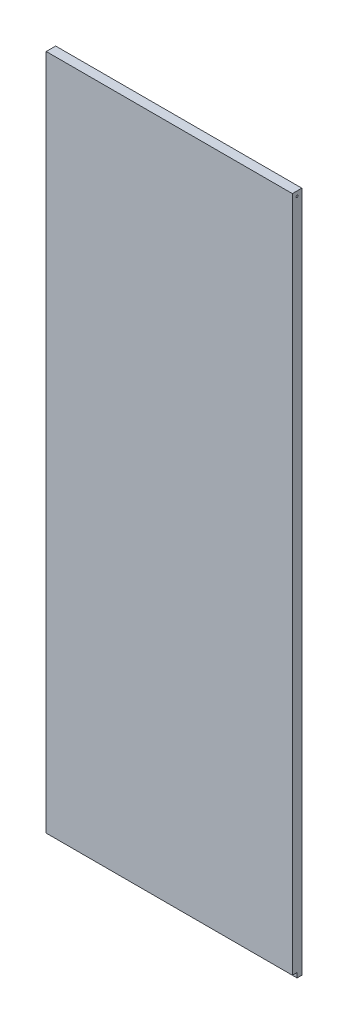
ISO-10303-21;
HEADER;
FILE_DESCRIPTION(('STEP AP214'),'2;1');
FILE_NAME('part.step','',(''),(''),'','','');
FILE_SCHEMA(('AUTOMOTIVE_DESIGN { 1 0 10303 214 1 1 1 1 }'));
ENDSEC;
DATA;
#1=APPLICATION_CONTEXT('core data for automotive mechanical design processes');
#2=APPLICATION_PROTOCOL_DEFINITION('international standard','automotive_design',2000,#1);
#3=PRODUCT_CONTEXT('',#1,'mechanical');
#4=PRODUCT('Part','Part','',(#3));
#5=PRODUCT_RELATED_PRODUCT_CATEGORY('part','',(#4));
#6=PRODUCT_DEFINITION_FORMATION('','',#4);
#7=PRODUCT_DEFINITION_CONTEXT('part definition',#1,'design');
#8=PRODUCT_DEFINITION('design','',#6,#7);
#9=PRODUCT_DEFINITION_SHAPE('','',#8);
#10=(LENGTH_UNIT() NAMED_UNIT(*) SI_UNIT(.MILLI.,.METRE.));
#11=(NAMED_UNIT(*) PLANE_ANGLE_UNIT() SI_UNIT($,.RADIAN.));
#12=(NAMED_UNIT(*) SI_UNIT($,.STERADIAN.) SOLID_ANGLE_UNIT());
#13=UNCERTAINTY_MEASURE_WITH_UNIT(LENGTH_MEASURE(1.E-05),#10,'distance_accuracy_value','');
#14=(GEOMETRIC_REPRESENTATION_CONTEXT(3) GLOBAL_UNCERTAINTY_ASSIGNED_CONTEXT((#13)) GLOBAL_UNIT_ASSIGNED_CONTEXT((#10,
#11,#12)) REPRESENTATION_CONTEXT('',''));
#15=CARTESIAN_POINT('',(0.,0.,0.));
#16=DIRECTION('',(0.,0.,1.));
#17=DIRECTION('',(1.,0.,0.));
#18=AXIS2_PLACEMENT_3D('',#15,#16,#17);
#19=CARTESIAN_POINT('',(323.85,0.,12.7));
#20=DIRECTION('',(0.,1.,0.));
#21=DIRECTION('',(0.,0.,1.));
#22=AXIS2_PLACEMENT_3D('',#19,#20,#21);
#23=PLANE('',#22);
#24=DIRECTION('',(1.,0.,0.));
#25=VECTOR('',#24,1.);
#26=CARTESIAN_POINT('',(-6.35,0.,6.35));
#27=LINE('',#26,#25);
#28=CARTESIAN_POINT('',(-6.35,0.,6.35));
#29=VERTEX_POINT('',#28);
#30=CARTESIAN_POINT('',(323.85,0.,6.35));
#31=VERTEX_POINT('',#30);
#32=EDGE_CURVE('E83',#29,#31,#27,.T.);
#33=ORIENTED_EDGE('',*,*,#32,.F.);
#34=DIRECTION('',(0.,0.,-1.));
#35=VECTOR('',#34,1.);
#36=CARTESIAN_POINT('',(-6.35,0.,12.7));
#37=LINE('',#36,#35);
#38=CARTESIAN_POINT('',(-6.35,0.,0.));
#39=VERTEX_POINT('',#38);
#40=EDGE_CURVE('E77',#29,#39,#37,.T.);
#41=ORIENTED_EDGE('',*,*,#40,.T.);
#42=DIRECTION('',(1.,0.,0.));
#43=VECTOR('',#42,1.);
#44=CARTESIAN_POINT('',(323.85,0.,0.));
#45=LINE('',#44,#43);
#46=CARTESIAN_POINT('',(323.85,0.,0.));
#47=VERTEX_POINT('',#46);
#48=EDGE_CURVE('E80',#39,#47,#45,.T.);
#49=ORIENTED_EDGE('',*,*,#48,.T.);
#50=DIRECTION('',(0.,0.,-1.));
#51=VECTOR('',#50,1.);
#52=CARTESIAN_POINT('',(323.85,0.,12.7));
#53=LINE('',#52,#51);
#54=EDGE_CURVE('E11',#31,#47,#53,.T.);
#55=ORIENTED_EDGE('',*,*,#54,.F.);
#56=EDGE_LOOP('',(#33,#41,#49,#55));
#57=FACE_BOUND('',#56,.T.);
#58=ADVANCED_FACE('F35',(#57),#23,.F.);
#59=CARTESIAN_POINT('',(323.85,419.1,12.7));
#60=DIRECTION('',(-1.,0.,0.));
#61=DIRECTION('',(0.,0.,1.));
#62=AXIS2_PLACEMENT_3D('',#59,#60,#61);
#63=PLANE('',#62);
#64=CARTESIAN_POINT('',(323.85,908.05,6.35));
#65=DIRECTION('',(-1.,0.,0.));
#66=DIRECTION('',(0.,0.,1.));
#67=AXIS2_PLACEMENT_3D('',#64,#65,#66);
#68=CIRCLE('',#67,1.26999999999998);
#69=CARTESIAN_POINT('',(323.85,908.05,7.61999999999998));
#70=VERTEX_POINT('',#69);
#71=EDGE_CURVE('E127',#70,#70,#68,.T.);
#72=ORIENTED_EDGE('',*,*,#71,.T.);
#73=EDGE_LOOP('',(#72));
#74=FACE_BOUND('',#73,.T.);
#75=DIRECTION('',(0.,1.,0.));
#76=VECTOR('',#75,1.);
#77=CARTESIAN_POINT('',(323.85,419.1,12.7));
#78=LINE('',#77,#76);
#79=CARTESIAN_POINT('',(323.85,6.35000000000013,12.7));
#80=VERTEX_POINT('',#79);
#81=CARTESIAN_POINT('',(323.85,914.4,12.7));
#82=VERTEX_POINT('',#81);
#83=EDGE_CURVE('E102',#80,#82,#78,.T.);
#84=ORIENTED_EDGE('',*,*,#83,.F.);
#85=DIRECTION('',(0.,0.,1.));
#86=VECTOR('',#85,1.);
#87=CARTESIAN_POINT('',(323.85,6.35,6.35));
#88=LINE('',#87,#86);
#89=CARTESIAN_POINT('',(323.85,6.35,6.35));
#90=VERTEX_POINT('',#89);
#91=EDGE_CURVE('E49',#90,#80,#88,.T.);
#92=ORIENTED_EDGE('',*,*,#91,.F.);
#93=DIRECTION('',(0.,1.,0.));
#94=VECTOR('',#93,1.);
#95=CARTESIAN_POINT('',(323.85,6.35,6.35));
#96=LINE('',#95,#94);
#97=EDGE_CURVE('E130',#31,#90,#96,.T.);
#98=ORIENTED_EDGE('',*,*,#97,.F.);
#99=ORIENTED_EDGE('',*,*,#54,.T.);
#100=DIRECTION('',(0.,1.,0.));
#101=VECTOR('',#100,1.);
#102=CARTESIAN_POINT('',(323.85,419.1,0.));
#103=LINE('',#102,#101);
#104=CARTESIAN_POINT('',(323.85,914.4,0.));
#105=VERTEX_POINT('',#104);
#106=EDGE_CURVE('E96',#47,#105,#103,.T.);
#107=ORIENTED_EDGE('',*,*,#106,.T.);
#108=DIRECTION('',(0.,0.,-1.));
#109=VECTOR('',#108,1.);
#110=CARTESIAN_POINT('',(323.85,914.4,12.7));
#111=LINE('',#110,#109);
#112=EDGE_CURVE('E42',#82,#105,#111,.T.);
#113=ORIENTED_EDGE('',*,*,#112,.F.);
#114=EDGE_LOOP('',(#84,#92,#98,#99,#107,#113));
#115=FACE_BOUND('',#114,.T.);
#116=ADVANCED_FACE('F115',(#74,#115),#63,.F.);
#117=CARTESIAN_POINT('',(-6.35,914.4,12.7));
#118=DIRECTION('',(0.,-1.,0.));
#119=DIRECTION('',(0.,0.,-1.));
#120=AXIS2_PLACEMENT_3D('',#117,#118,#119);
#121=PLANE('',#120);
#122=DIRECTION('',(-1.,0.,0.));
#123=VECTOR('',#122,1.);
#124=CARTESIAN_POINT('',(-6.35,914.4,0.));
#125=LINE('',#124,#123);
#126=CARTESIAN_POINT('',(-6.35,914.4,0.));
#127=VERTEX_POINT('',#126);
#128=EDGE_CURVE('E103',#105,#127,#125,.T.);
#129=ORIENTED_EDGE('',*,*,#128,.T.);
#130=DIRECTION('',(0.,0.,-1.));
#131=VECTOR('',#130,1.);
#132=CARTESIAN_POINT('',(-6.35,914.4,12.7));
#133=LINE('',#132,#131);
#134=CARTESIAN_POINT('',(-6.35,914.4,12.7));
#135=VERTEX_POINT('',#134);
#136=EDGE_CURVE('E87',#135,#127,#133,.T.);
#137=ORIENTED_EDGE('',*,*,#136,.F.);
#138=DIRECTION('',(-1.,0.,0.));
#139=VECTOR('',#138,1.);
#140=CARTESIAN_POINT('',(-6.35,914.4,12.7));
#141=LINE('',#140,#139);
#142=EDGE_CURVE('E58',#82,#135,#141,.T.);
#143=ORIENTED_EDGE('',*,*,#142,.F.);
#144=ORIENTED_EDGE('',*,*,#112,.T.);
#145=EDGE_LOOP('',(#129,#137,#143,#144));
#146=FACE_BOUND('',#145,.T.);
#147=ADVANCED_FACE('F112',(#146),#121,.F.);
#148=CARTESIAN_POINT('',(-6.35,419.1,12.7));
#149=DIRECTION('',(1.,0.,0.));
#150=DIRECTION('',(0.,0.,-1.));
#151=AXIS2_PLACEMENT_3D('',#148,#149,#150);
#152=PLANE('',#151);
#153=CARTESIAN_POINT('',(-6.35,908.05,6.35));
#154=DIRECTION('',(-1.,0.,0.));
#155=DIRECTION('',(0.,0.,1.));
#156=AXIS2_PLACEMENT_3D('',#153,#154,#155);
#157=CIRCLE('',#156,1.26999999999998);
#158=CARTESIAN_POINT('',(-6.35,908.05,7.61999999999998));
#159=VERTEX_POINT('',#158);
#160=EDGE_CURVE('E136',#159,#159,#157,.T.);
#161=ORIENTED_EDGE('',*,*,#160,.F.);
#162=EDGE_LOOP('',(#161));
#163=FACE_BOUND('',#162,.T.);
#164=DIRECTION('',(0.,-1.,0.));
#165=VECTOR('',#164,1.);
#166=CARTESIAN_POINT('',(-6.35,6.34999999999997,6.35));
#167=LINE('',#166,#165);
#168=CARTESIAN_POINT('',(-6.35,6.34999999999997,6.35));
#169=VERTEX_POINT('',#168);
#170=EDGE_CURVE('E126',#169,#29,#167,.T.);
#171=ORIENTED_EDGE('',*,*,#170,.F.);
#172=DIRECTION('',(0.,0.,1.));
#173=VECTOR('',#172,1.);
#174=CARTESIAN_POINT('',(-6.35,6.34999999999997,6.35));
#175=LINE('',#174,#173);
#176=CARTESIAN_POINT('',(-6.35,6.34999999999997,12.7));
#177=VERTEX_POINT('',#176);
#178=EDGE_CURVE('E97',#169,#177,#175,.T.);
#179=ORIENTED_EDGE('',*,*,#178,.T.);
#180=DIRECTION('',(0.,-1.,0.));
#181=VECTOR('',#180,1.);
#182=CARTESIAN_POINT('',(-6.35,419.1,12.7));
#183=LINE('',#182,#181);
#184=EDGE_CURVE('E88',#135,#177,#183,.T.);
#185=ORIENTED_EDGE('',*,*,#184,.F.);
#186=ORIENTED_EDGE('',*,*,#136,.T.);
#187=DIRECTION('',(0.,-1.,0.));
#188=VECTOR('',#187,1.);
#189=CARTESIAN_POINT('',(-6.35,419.1,0.));
#190=LINE('',#189,#188);
#191=EDGE_CURVE('E94',#127,#39,#190,.T.);
#192=ORIENTED_EDGE('',*,*,#191,.T.);
#193=ORIENTED_EDGE('',*,*,#40,.F.);
#194=EDGE_LOOP('',(#171,#179,#185,#186,#192,#193));
#195=FACE_BOUND('',#194,.T.);
#196=ADVANCED_FACE('F100',(#163,#195),#152,.F.);
#197=CARTESIAN_POINT('',(0.,0.,12.7));
#198=DIRECTION('',(0.,0.,-1.));
#199=DIRECTION('',(-1.,0.,0.));
#200=AXIS2_PLACEMENT_3D('',#197,#198,#199);
#201=PLANE('',#200);
#202=ORIENTED_EDGE('',*,*,#184,.T.);
#203=DIRECTION('',(-1.,0.,0.));
#204=VECTOR('',#203,1.);
#205=CARTESIAN_POINT('',(-6.35,6.34999999999997,12.7));
#206=LINE('',#205,#204);
#207=EDGE_CURVE('E124',#80,#177,#206,.T.);
#208=ORIENTED_EDGE('',*,*,#207,.F.);
#209=ORIENTED_EDGE('',*,*,#83,.T.);
#210=ORIENTED_EDGE('',*,*,#142,.T.);
#211=EDGE_LOOP('',(#202,#208,#209,#210));
#212=FACE_BOUND('',#211,.T.);
#213=ADVANCED_FACE('F151',(#212),#201,.F.);
#214=CARTESIAN_POINT('',(0.,0.,0.));
#215=DIRECTION('',(0.,0.,-1.));
#216=DIRECTION('',(-1.,0.,0.));
#217=AXIS2_PLACEMENT_3D('',#214,#215,#216);
#218=PLANE('',#217);
#219=ORIENTED_EDGE('',*,*,#48,.F.);
#220=ORIENTED_EDGE('',*,*,#191,.F.);
#221=ORIENTED_EDGE('',*,*,#128,.F.);
#222=ORIENTED_EDGE('',*,*,#106,.F.);
#223=EDGE_LOOP('',(#219,#220,#221,#222));
#224=FACE_BOUND('',#223,.T.);
#225=ADVANCED_FACE('F92',(#224),#218,.T.);
#226=CARTESIAN_POINT('',(-6.35,6.34999999999997,6.35));
#227=DIRECTION('',(0.,1.,0.));
#228=DIRECTION('',(-1.,0.,0.));
#229=AXIS2_PLACEMENT_3D('',#226,#227,#228);
#230=PLANE('',#229);
#231=ORIENTED_EDGE('',*,*,#207,.T.);
#232=ORIENTED_EDGE('',*,*,#178,.F.);
#233=DIRECTION('',(-1.,0.,0.));
#234=VECTOR('',#233,1.);
#235=CARTESIAN_POINT('',(-6.35,6.34999999999997,6.35));
#236=LINE('',#235,#234);
#237=EDGE_CURVE('E121',#90,#169,#236,.T.);
#238=ORIENTED_EDGE('',*,*,#237,.F.);
#239=ORIENTED_EDGE('',*,*,#91,.T.);
#240=EDGE_LOOP('',(#231,#232,#238,#239));
#241=FACE_BOUND('',#240,.T.);
#242=ADVANCED_FACE('F180',(#241),#230,.F.);
#243=CARTESIAN_POINT('',(0.,0.,6.35));
#244=DIRECTION('',(0.,0.,1.));
#245=DIRECTION('',(1.,0.,0.));
#246=AXIS2_PLACEMENT_3D('',#243,#244,#245);
#247=PLANE('',#246);
#248=ORIENTED_EDGE('',*,*,#170,.T.);
#249=ORIENTED_EDGE('',*,*,#32,.T.);
#250=ORIENTED_EDGE('',*,*,#97,.T.);
#251=ORIENTED_EDGE('',*,*,#237,.T.);
#252=EDGE_LOOP('',(#248,#249,#250,#251));
#253=FACE_BOUND('',#252,.T.);
#254=ADVANCED_FACE('F146',(#253),#247,.T.);
#255=CARTESIAN_POINT('',(323.85,908.05,6.35));
#256=DIRECTION('',(-1.,0.,0.));
#257=DIRECTION('',(0.,0.,1.));
#258=AXIS2_PLACEMENT_3D('',#255,#256,#257);
#259=CYLINDRICAL_SURFACE('',#258,1.26999999999998);
#260=ORIENTED_EDGE('',*,*,#71,.F.);
#261=EDGE_LOOP('',(#260));
#262=FACE_BOUND('',#261,.T.);
#263=ORIENTED_EDGE('',*,*,#160,.T.);
#264=EDGE_LOOP('',(#263));
#265=FACE_BOUND('',#264,.T.);
#266=ADVANCED_FACE('F143',(#262,#265),#259,.F.);
#267=CLOSED_SHELL('',(#58,#116,#147,#196,#213,#225,#242,#254,#266));
#268=MANIFOLD_SOLID_BREP('B2',#267);
#269=ADVANCED_BREP_SHAPE_REPRESENTATION('',(#18,#268),#14);
#270=SHAPE_DEFINITION_REPRESENTATION(#9,#269);
ENDSEC;
END-ISO-10303-21;
